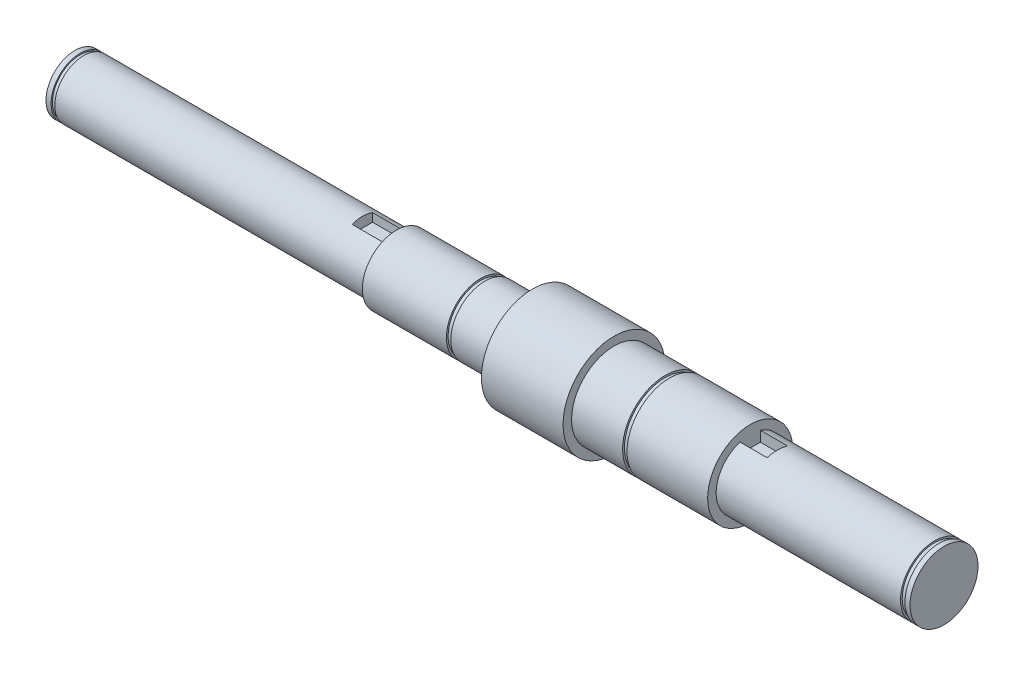
ISO-10303-21;
HEADER;
FILE_DESCRIPTION(('STEP AP214'),'2;1');
FILE_NAME('part.step','',(''),(''),'','','');
FILE_SCHEMA(('AUTOMOTIVE_DESIGN { 1 0 10303 214 1 1 1 1 }'));
ENDSEC;
DATA;
#1=APPLICATION_CONTEXT('core data for automotive mechanical design processes');
#2=APPLICATION_PROTOCOL_DEFINITION('international standard','automotive_design',2000,#1);
#3=PRODUCT_CONTEXT('',#1,'mechanical');
#4=PRODUCT('Part','Part','',(#3));
#5=PRODUCT_RELATED_PRODUCT_CATEGORY('part','',(#4));
#6=PRODUCT_DEFINITION_FORMATION('','',#4);
#7=PRODUCT_DEFINITION_CONTEXT('part definition',#1,'design');
#8=PRODUCT_DEFINITION('design','',#6,#7);
#9=PRODUCT_DEFINITION_SHAPE('','',#8);
#10=(LENGTH_UNIT() NAMED_UNIT(*) SI_UNIT(.MILLI.,.METRE.));
#11=(NAMED_UNIT(*) PLANE_ANGLE_UNIT() SI_UNIT($,.RADIAN.));
#12=(NAMED_UNIT(*) SI_UNIT($,.STERADIAN.) SOLID_ANGLE_UNIT());
#13=UNCERTAINTY_MEASURE_WITH_UNIT(LENGTH_MEASURE(1.E-05),#10,'distance_accuracy_value','');
#14=(GEOMETRIC_REPRESENTATION_CONTEXT(3) GLOBAL_UNCERTAINTY_ASSIGNED_CONTEXT((#13)) GLOBAL_UNIT_ASSIGNED_CONTEXT((#10,
#11,#12)) REPRESENTATION_CONTEXT('',''));
#15=CARTESIAN_POINT('',(0.,0.,0.));
#16=DIRECTION('',(0.,0.,1.));
#17=DIRECTION('',(1.,0.,0.));
#18=AXIS2_PLACEMENT_3D('',#15,#16,#17);
#19=CARTESIAN_POINT('',(-127.75,0.,0.));
#20=DIRECTION('',(-1.,0.,0.));
#21=DIRECTION('',(0.,0.,1.));
#22=AXIS2_PLACEMENT_3D('',#19,#20,#21);
#23=CYLINDRICAL_SURFACE('',#22,10.);
#24=CARTESIAN_POINT('',(124.95,0.,0.));
#25=DIRECTION('',(-1.,0.,0.));
#26=DIRECTION('',(0.,0.,1.));
#27=AXIS2_PLACEMENT_3D('',#24,#25,#26);
#28=CIRCLE('',#27,10.);
#29=CARTESIAN_POINT('',(124.95,0.,10.));
#30=VERTEX_POINT('',#29);
#31=EDGE_CURVE('E178',#30,#30,#28,.T.);
#32=ORIENTED_EDGE('',*,*,#31,.T.);
#33=EDGE_LOOP('',(#32));
#34=FACE_BOUND('',#33,.T.);
#35=DIRECTION('',(-1.,0.,0.));
#36=VECTOR('',#35,1.);
#37=CARTESIAN_POINT('',(-127.75,9.53939201416946,3.));
#38=LINE('',#37,#36);
#39=CARTESIAN_POINT('',(70.75,9.53939201416946,3.));
#40=VERTEX_POINT('',#39);
#41=CARTESIAN_POINT('',(78.75,9.53939201416945,3.));
#42=VERTEX_POINT('',#41);
#43=EDGE_CURVE('E107',#40,#42,#38,.F.);
#44=ORIENTED_EDGE('',*,*,#43,.F.);
#45=CARTESIAN_POINT('',(70.75,0.,0.));
#46=DIRECTION('',(-1.,0.,0.));
#47=DIRECTION('',(0.,0.,1.));
#48=AXIS2_PLACEMENT_3D('',#45,#46,#47);
#49=CIRCLE('',#48,10.);
#50=CARTESIAN_POINT('',(70.75,9.53939201416946,-3.));
#51=VERTEX_POINT('',#50);
#52=EDGE_CURVE('E175',#51,#40,#49,.T.);
#53=ORIENTED_EDGE('',*,*,#52,.F.);
#54=DIRECTION('',(-1.,0.,0.));
#55=VECTOR('',#54,1.);
#56=CARTESIAN_POINT('',(-127.75,9.53939201416946,-3.));
#57=LINE('',#56,#55);
#58=CARTESIAN_POINT('',(78.75,9.53939201416945,-3.));
#59=VERTEX_POINT('',#58);
#60=EDGE_CURVE('E123',#59,#51,#57,.T.);
#61=ORIENTED_EDGE('',*,*,#60,.F.);
#62=CARTESIAN_POINT('',(78.75,0.,0.));
#63=DIRECTION('',(1.,0.,0.));
#64=DIRECTION('',(0.,0.,-1.));
#65=AXIS2_PLACEMENT_3D('',#62,#63,#64);
#66=CIRCLE('',#65,10.);
#67=EDGE_CURVE('E11',#59,#42,#66,.T.);
#68=ORIENTED_EDGE('',*,*,#67,.T.);
#69=EDGE_LOOP('',(#44,#53,#61,#68));
#70=FACE_BOUND('',#69,.T.);
#71=ADVANCED_FACE('F33',(#34,#70),#23,.T.);
#72=CARTESIAN_POINT('',(-127.75,0.,0.));
#73=DIRECTION('',(-1.,0.,0.));
#74=DIRECTION('',(0.,0.,1.));
#75=AXIS2_PLACEMENT_3D('',#72,#73,#74);
#76=CYLINDRICAL_SURFACE('',#75,8.5);
#77=CARTESIAN_POINT('',(-125.15,0.,0.));
#78=DIRECTION('',(-1.,0.,0.));
#79=DIRECTION('',(0.,0.,1.));
#80=AXIS2_PLACEMENT_3D('',#77,#78,#79);
#81=CIRCLE('',#80,8.5);
#82=CARTESIAN_POINT('',(-125.15,0.,8.5));
#83=VERTEX_POINT('',#82);
#84=EDGE_CURVE('E205',#83,#83,#81,.T.);
#85=ORIENTED_EDGE('',*,*,#84,.F.);
#86=EDGE_LOOP('',(#85));
#87=FACE_BOUND('',#86,.T.);
#88=DIRECTION('',(-1.,0.,0.));
#89=VECTOR('',#88,1.);
#90=CARTESIAN_POINT('',(-127.75,7.95298686029343,-3.));
#91=LINE('',#90,#89);
#92=CARTESIAN_POINT('',(-33.25,7.95298686029343,-3.));
#93=VERTEX_POINT('',#92);
#94=CARTESIAN_POINT('',(-43.25,7.95298686029343,-3.));
#95=VERTEX_POINT('',#94);
#96=EDGE_CURVE('E41',#93,#95,#91,.T.);
#97=ORIENTED_EDGE('',*,*,#96,.F.);
#98=CARTESIAN_POINT('',(-33.25,0.,0.));
#99=DIRECTION('',(-1.,0.,0.));
#100=DIRECTION('',(0.,0.,1.));
#101=AXIS2_PLACEMENT_3D('',#98,#99,#100);
#102=CIRCLE('',#101,8.5);
#103=CARTESIAN_POINT('',(-33.25,7.95298686029343,3.));
#104=VERTEX_POINT('',#103);
#105=EDGE_CURVE('E208',#93,#104,#102,.T.);
#106=ORIENTED_EDGE('',*,*,#105,.T.);
#107=DIRECTION('',(-1.,0.,0.));
#108=VECTOR('',#107,1.);
#109=CARTESIAN_POINT('',(-127.75,7.95298686029343,3.));
#110=LINE('',#109,#108);
#111=CARTESIAN_POINT('',(-43.25,7.95298686029343,3.));
#112=VERTEX_POINT('',#111);
#113=EDGE_CURVE('E227',#112,#104,#110,.F.);
#114=ORIENTED_EDGE('',*,*,#113,.F.);
#115=CARTESIAN_POINT('',(-43.25,0.,0.));
#116=DIRECTION('',(1.,0.,0.));
#117=DIRECTION('',(0.,0.,-1.));
#118=AXIS2_PLACEMENT_3D('',#115,#116,#117);
#119=CIRCLE('',#118,8.5);
#120=EDGE_CURVE('E56',#95,#112,#119,.T.);
#121=ORIENTED_EDGE('',*,*,#120,.F.);
#122=EDGE_LOOP('',(#97,#106,#114,#121));
#123=FACE_BOUND('',#122,.T.);
#124=ADVANCED_FACE('F236',(#87,#123),#76,.T.);
#125=CARTESIAN_POINT('',(-127.75,0.,0.));
#126=DIRECTION('',(-1.,0.,0.));
#127=DIRECTION('',(0.,0.,1.));
#128=AXIS2_PLACEMENT_3D('',#125,#126,#127);
#129=CYLINDRICAL_SURFACE('',#128,10.);
#130=CARTESIAN_POINT('',(-7.25000000000001,0.,0.));
#131=DIRECTION('',(-1.,0.,0.));
#132=DIRECTION('',(0.,0.,1.));
#133=AXIS2_PLACEMENT_3D('',#130,#131,#132);
#134=CIRCLE('',#133,10.);
#135=CARTESIAN_POINT('',(-7.25000000000001,0.,10.));
#136=VERTEX_POINT('',#135);
#137=EDGE_CURVE('E223',#136,#136,#134,.T.);
#138=ORIENTED_EDGE('',*,*,#137,.F.);
#139=EDGE_LOOP('',(#138));
#140=FACE_BOUND('',#139,.T.);
#141=CARTESIAN_POINT('',(6.75000000000001,0.,0.));
#142=DIRECTION('',(-1.,0.,0.));
#143=DIRECTION('',(0.,0.,1.));
#144=AXIS2_PLACEMENT_3D('',#141,#142,#143);
#145=CIRCLE('',#144,10.);
#146=CARTESIAN_POINT('',(6.75000000000001,0.,10.));
#147=VERTEX_POINT('',#146);
#148=EDGE_CURVE('E148',#147,#147,#145,.T.);
#149=ORIENTED_EDGE('',*,*,#148,.T.);
#150=EDGE_LOOP('',(#149));
#151=FACE_BOUND('',#150,.T.);
#152=ADVANCED_FACE('F35',(#140,#151),#129,.T.);
#153=CARTESIAN_POINT('',(-7.25,10.,0.));
#154=DIRECTION('',(1.,0.,0.));
#155=DIRECTION('',(0.,0.,-1.));
#156=AXIS2_PLACEMENT_3D('',#153,#154,#155);
#157=PLANE('',#156);
#158=CARTESIAN_POINT('',(-7.25000000000001,0.,0.));
#159=DIRECTION('',(-1.,0.,0.));
#160=DIRECTION('',(0.,0.,1.));
#161=AXIS2_PLACEMENT_3D('',#158,#159,#160);
#162=CIRCLE('',#161,9.5);
#163=CARTESIAN_POINT('',(-7.25000000000001,0.,9.5));
#164=VERTEX_POINT('',#163);
#165=EDGE_CURVE('E220',#164,#164,#162,.T.);
#166=ORIENTED_EDGE('',*,*,#165,.F.);
#167=EDGE_LOOP('',(#166));
#168=FACE_BOUND('',#167,.T.);
#169=ORIENTED_EDGE('',*,*,#137,.T.);
#170=EDGE_LOOP('',(#169));
#171=FACE_BOUND('',#170,.T.);
#172=ADVANCED_FACE('F265',(#168,#171),#157,.F.);
#173=CARTESIAN_POINT('',(-127.75,0.,0.));
#174=DIRECTION('',(-1.,0.,0.));
#175=DIRECTION('',(0.,0.,1.));
#176=AXIS2_PLACEMENT_3D('',#173,#174,#175);
#177=CYLINDRICAL_SURFACE('',#176,9.5);
#178=CARTESIAN_POINT('',(-8.55,0.,0.));
#179=DIRECTION('',(-1.,0.,0.));
#180=DIRECTION('',(0.,0.,1.));
#181=AXIS2_PLACEMENT_3D('',#178,#179,#180);
#182=CIRCLE('',#181,9.5);
#183=CARTESIAN_POINT('',(-8.55,0.,9.5));
#184=VERTEX_POINT('',#183);
#185=EDGE_CURVE('E217',#184,#184,#182,.T.);
#186=ORIENTED_EDGE('',*,*,#185,.F.);
#187=EDGE_LOOP('',(#186));
#188=FACE_BOUND('',#187,.T.);
#189=ORIENTED_EDGE('',*,*,#165,.T.);
#190=EDGE_LOOP('',(#189));
#191=FACE_BOUND('',#190,.T.);
#192=ADVANCED_FACE('F259',(#188,#191),#177,.T.);
#193=CARTESIAN_POINT('',(-8.55,10.,0.));
#194=DIRECTION('',(-1.,0.,0.));
#195=DIRECTION('',(0.,0.,1.));
#196=AXIS2_PLACEMENT_3D('',#193,#194,#195);
#197=PLANE('',#196);
#198=CARTESIAN_POINT('',(-8.55,0.,0.));
#199=DIRECTION('',(-1.,0.,0.));
#200=DIRECTION('',(0.,0.,1.));
#201=AXIS2_PLACEMENT_3D('',#198,#199,#200);
#202=CIRCLE('',#201,10.);
#203=CARTESIAN_POINT('',(-8.55,0.,10.));
#204=VERTEX_POINT('',#203);
#205=EDGE_CURVE('E214',#204,#204,#202,.T.);
#206=ORIENTED_EDGE('',*,*,#205,.F.);
#207=EDGE_LOOP('',(#206));
#208=FACE_BOUND('',#207,.T.);
#209=ORIENTED_EDGE('',*,*,#185,.T.);
#210=EDGE_LOOP('',(#209));
#211=FACE_BOUND('',#210,.T.);
#212=ADVANCED_FACE('F253',(#208,#211),#197,.F.);
#213=CARTESIAN_POINT('',(-127.75,0.,0.));
#214=DIRECTION('',(-1.,0.,0.));
#215=DIRECTION('',(0.,0.,1.));
#216=AXIS2_PLACEMENT_3D('',#213,#214,#215);
#217=CYLINDRICAL_SURFACE('',#216,10.);
#218=CARTESIAN_POINT('',(-33.25,0.,0.));
#219=DIRECTION('',(-1.,0.,0.));
#220=DIRECTION('',(0.,0.,1.));
#221=AXIS2_PLACEMENT_3D('',#218,#219,#220);
#222=CIRCLE('',#221,10.);
#223=CARTESIAN_POINT('',(-33.25,0.,10.));
#224=VERTEX_POINT('',#223);
#225=EDGE_CURVE('E211',#224,#224,#222,.T.);
#226=ORIENTED_EDGE('',*,*,#225,.F.);
#227=EDGE_LOOP('',(#226));
#228=FACE_BOUND('',#227,.T.);
#229=ORIENTED_EDGE('',*,*,#205,.T.);
#230=EDGE_LOOP('',(#229));
#231=FACE_BOUND('',#230,.T.);
#232=ADVANCED_FACE('F247',(#228,#231),#217,.T.);
#233=CARTESIAN_POINT('',(-33.25,8.5,0.));
#234=DIRECTION('',(1.,0.,0.));
#235=DIRECTION('',(0.,0.,-1.));
#236=AXIS2_PLACEMENT_3D('',#233,#234,#235);
#237=PLANE('',#236);
#238=ORIENTED_EDGE('',*,*,#105,.F.);
#239=DIRECTION('',(0.,-1.,0.));
#240=VECTOR('',#239,1.);
#241=CARTESIAN_POINT('',(-33.25,5.5,-3.));
#242=LINE('',#241,#240);
#243=CARTESIAN_POINT('',(-33.25,5.5,-3.));
#244=VERTEX_POINT('',#243);
#245=EDGE_CURVE('E131',#93,#244,#242,.T.);
#246=ORIENTED_EDGE('',*,*,#245,.T.);
#247=DIRECTION('',(0.,0.,1.));
#248=VECTOR('',#247,1.);
#249=CARTESIAN_POINT('',(-33.25,5.5,-3.));
#250=LINE('',#249,#248);
#251=CARTESIAN_POINT('',(-33.25,5.5,3.));
#252=VERTEX_POINT('',#251);
#253=EDGE_CURVE('E140',#244,#252,#250,.T.);
#254=ORIENTED_EDGE('',*,*,#253,.T.);
#255=DIRECTION('',(0.,1.,0.));
#256=VECTOR('',#255,1.);
#257=CARTESIAN_POINT('',(-33.25,5.5,3.));
#258=LINE('',#257,#256);
#259=EDGE_CURVE('E48',#252,#104,#258,.T.);
#260=ORIENTED_EDGE('',*,*,#259,.T.);
#261=EDGE_LOOP('',(#238,#246,#254,#260));
#262=FACE_BOUND('',#261,.T.);
#263=ORIENTED_EDGE('',*,*,#225,.T.);
#264=EDGE_LOOP('',(#263));
#265=FACE_BOUND('',#264,.T.);
#266=ADVANCED_FACE('F243',(#262,#265),#237,.F.);
#267=CARTESIAN_POINT('',(-125.15,8.5,0.));
#268=DIRECTION('',(1.,0.,0.));
#269=DIRECTION('',(0.,0.,-1.));
#270=AXIS2_PLACEMENT_3D('',#267,#268,#269);
#271=PLANE('',#270);
#272=CARTESIAN_POINT('',(-125.15,0.,0.));
#273=DIRECTION('',(-1.,0.,0.));
#274=DIRECTION('',(0.,0.,1.));
#275=AXIS2_PLACEMENT_3D('',#272,#273,#274);
#276=CIRCLE('',#275,8.1);
#277=CARTESIAN_POINT('',(-125.15,0.,8.1));
#278=VERTEX_POINT('',#277);
#279=EDGE_CURVE('E202',#278,#278,#276,.T.);
#280=ORIENTED_EDGE('',*,*,#279,.F.);
#281=EDGE_LOOP('',(#280));
#282=FACE_BOUND('',#281,.T.);
#283=ORIENTED_EDGE('',*,*,#84,.T.);
#284=EDGE_LOOP('',(#283));
#285=FACE_BOUND('',#284,.T.);
#286=ADVANCED_FACE('F246',(#282,#285),#271,.F.);
#287=CARTESIAN_POINT('',(-127.75,0.,0.));
#288=DIRECTION('',(-1.,0.,0.));
#289=DIRECTION('',(0.,0.,1.));
#290=AXIS2_PLACEMENT_3D('',#287,#288,#289);
#291=CYLINDRICAL_SURFACE('',#290,8.1);
#292=CARTESIAN_POINT('',(-126.25,0.,0.));
#293=DIRECTION('',(-1.,0.,0.));
#294=DIRECTION('',(0.,0.,1.));
#295=AXIS2_PLACEMENT_3D('',#292,#293,#294);
#296=CIRCLE('',#295,8.1);
#297=CARTESIAN_POINT('',(-126.25,0.,8.1));
#298=VERTEX_POINT('',#297);
#299=EDGE_CURVE('E199',#298,#298,#296,.T.);
#300=ORIENTED_EDGE('',*,*,#299,.F.);
#301=EDGE_LOOP('',(#300));
#302=FACE_BOUND('',#301,.T.);
#303=ORIENTED_EDGE('',*,*,#279,.T.);
#304=EDGE_LOOP('',(#303));
#305=FACE_BOUND('',#304,.T.);
#306=ADVANCED_FACE('F373',(#302,#305),#291,.T.);
#307=CARTESIAN_POINT('',(-126.25,8.5,0.));
#308=DIRECTION('',(-1.,0.,0.));
#309=DIRECTION('',(0.,0.,1.));
#310=AXIS2_PLACEMENT_3D('',#307,#308,#309);
#311=PLANE('',#310);
#312=CARTESIAN_POINT('',(-126.25,0.,0.));
#313=DIRECTION('',(-1.,0.,0.));
#314=DIRECTION('',(0.,0.,1.));
#315=AXIS2_PLACEMENT_3D('',#312,#313,#314);
#316=CIRCLE('',#315,8.5);
#317=CARTESIAN_POINT('',(-126.25,0.,8.5));
#318=VERTEX_POINT('',#317);
#319=EDGE_CURVE('E196',#318,#318,#316,.T.);
#320=ORIENTED_EDGE('',*,*,#319,.F.);
#321=EDGE_LOOP('',(#320));
#322=FACE_BOUND('',#321,.T.);
#323=ORIENTED_EDGE('',*,*,#299,.T.);
#324=EDGE_LOOP('',(#323));
#325=FACE_BOUND('',#324,.T.);
#326=ADVANCED_FACE('F369',(#322,#325),#311,.F.);
#327=CARTESIAN_POINT('',(-127.75,0.,0.));
#328=DIRECTION('',(-1.,0.,0.));
#329=DIRECTION('',(0.,0.,1.));
#330=AXIS2_PLACEMENT_3D('',#327,#328,#329);
#331=CYLINDRICAL_SURFACE('',#330,8.5);
#332=CARTESIAN_POINT('',(-127.75,0.,0.));
#333=DIRECTION('',(-1.,0.,0.));
#334=DIRECTION('',(0.,0.,1.));
#335=AXIS2_PLACEMENT_3D('',#332,#333,#334);
#336=CIRCLE('',#335,8.5);
#337=CARTESIAN_POINT('',(-127.75,0.,8.5));
#338=VERTEX_POINT('',#337);
#339=EDGE_CURVE('E193',#338,#338,#336,.T.);
#340=ORIENTED_EDGE('',*,*,#339,.F.);
#341=EDGE_LOOP('',(#340));
#342=FACE_BOUND('',#341,.T.);
#343=ORIENTED_EDGE('',*,*,#319,.T.);
#344=EDGE_LOOP('',(#343));
#345=FACE_BOUND('',#344,.T.);
#346=ADVANCED_FACE('F365',(#342,#345),#331,.T.);
#347=CARTESIAN_POINT('',(-127.75,0.,0.));
#348=DIRECTION('',(1.,0.,0.));
#349=DIRECTION('',(0.,0.,-1.));
#350=AXIS2_PLACEMENT_3D('',#347,#348,#349);
#351=PLANE('',#350);
#352=ORIENTED_EDGE('',*,*,#339,.T.);
#353=EDGE_LOOP('',(#352));
#354=FACE_BOUND('',#353,.T.);
#355=ADVANCED_FACE('F361',(#354),#351,.F.);
#356=CARTESIAN_POINT('',(127.75,10.,0.));
#357=DIRECTION('',(-1.,0.,0.));
#358=DIRECTION('',(0.,0.,1.));
#359=AXIS2_PLACEMENT_3D('',#356,#357,#358);
#360=PLANE('',#359);
#361=CARTESIAN_POINT('',(127.75,0.,0.));
#362=DIRECTION('',(-1.,0.,0.));
#363=DIRECTION('',(0.,0.,1.));
#364=AXIS2_PLACEMENT_3D('',#361,#362,#363);
#365=CIRCLE('',#364,10.);
#366=CARTESIAN_POINT('',(127.75,0.,10.));
#367=VERTEX_POINT('',#366);
#368=EDGE_CURVE('E190',#367,#367,#365,.T.);
#369=ORIENTED_EDGE('',*,*,#368,.F.);
#370=EDGE_LOOP('',(#369));
#371=FACE_BOUND('',#370,.T.);
#372=ADVANCED_FACE('F357',(#371),#360,.F.);
#373=CARTESIAN_POINT('',(-127.75,0.,0.));
#374=DIRECTION('',(-1.,0.,0.));
#375=DIRECTION('',(0.,0.,1.));
#376=AXIS2_PLACEMENT_3D('',#373,#374,#375);
#377=CYLINDRICAL_SURFACE('',#376,10.);
#378=CARTESIAN_POINT('',(126.25,0.,0.));
#379=DIRECTION('',(-1.,0.,0.));
#380=DIRECTION('',(0.,0.,1.));
#381=AXIS2_PLACEMENT_3D('',#378,#379,#380);
#382=CIRCLE('',#381,10.);
#383=CARTESIAN_POINT('',(126.25,0.,10.));
#384=VERTEX_POINT('',#383);
#385=EDGE_CURVE('E187',#384,#384,#382,.T.);
#386=ORIENTED_EDGE('',*,*,#385,.F.);
#387=EDGE_LOOP('',(#386));
#388=FACE_BOUND('',#387,.T.);
#389=ORIENTED_EDGE('',*,*,#368,.T.);
#390=EDGE_LOOP('',(#389));
#391=FACE_BOUND('',#390,.T.);
#392=ADVANCED_FACE('F353',(#388,#391),#377,.T.);
#393=CARTESIAN_POINT('',(126.25,10.,0.));
#394=DIRECTION('',(1.,0.,0.));
#395=DIRECTION('',(0.,0.,-1.));
#396=AXIS2_PLACEMENT_3D('',#393,#394,#395);
#397=PLANE('',#396);
#398=CARTESIAN_POINT('',(126.25,0.,0.));
#399=DIRECTION('',(-1.,0.,0.));
#400=DIRECTION('',(0.,0.,1.));
#401=AXIS2_PLACEMENT_3D('',#398,#399,#400);
#402=CIRCLE('',#401,9.5);
#403=CARTESIAN_POINT('',(126.25,0.,9.5));
#404=VERTEX_POINT('',#403);
#405=EDGE_CURVE('E184',#404,#404,#402,.T.);
#406=ORIENTED_EDGE('',*,*,#405,.F.);
#407=EDGE_LOOP('',(#406));
#408=FACE_BOUND('',#407,.T.);
#409=ORIENTED_EDGE('',*,*,#385,.T.);
#410=EDGE_LOOP('',(#409));
#411=FACE_BOUND('',#410,.T.);
#412=ADVANCED_FACE('F349',(#408,#411),#397,.F.);
#413=CARTESIAN_POINT('',(-127.75,0.,0.));
#414=DIRECTION('',(-1.,0.,0.));
#415=DIRECTION('',(0.,0.,1.));
#416=AXIS2_PLACEMENT_3D('',#413,#414,#415);
#417=CYLINDRICAL_SURFACE('',#416,9.5);
#418=CARTESIAN_POINT('',(124.95,0.,0.));
#419=DIRECTION('',(-1.,0.,0.));
#420=DIRECTION('',(0.,0.,1.));
#421=AXIS2_PLACEMENT_3D('',#418,#419,#420);
#422=CIRCLE('',#421,9.5);
#423=CARTESIAN_POINT('',(124.95,0.,9.5));
#424=VERTEX_POINT('',#423);
#425=EDGE_CURVE('E181',#424,#424,#422,.T.);
#426=ORIENTED_EDGE('',*,*,#425,.F.);
#427=EDGE_LOOP('',(#426));
#428=FACE_BOUND('',#427,.T.);
#429=ORIENTED_EDGE('',*,*,#405,.T.);
#430=EDGE_LOOP('',(#429));
#431=FACE_BOUND('',#430,.T.);
#432=ADVANCED_FACE('F333',(#428,#431),#417,.T.);
#433=CARTESIAN_POINT('',(124.95,10.,0.));
#434=DIRECTION('',(-1.,0.,0.));
#435=DIRECTION('',(0.,0.,1.));
#436=AXIS2_PLACEMENT_3D('',#433,#434,#435);
#437=PLANE('',#436);
#438=ORIENTED_EDGE('',*,*,#31,.F.);
#439=EDGE_LOOP('',(#438));
#440=FACE_BOUND('',#439,.T.);
#441=ORIENTED_EDGE('',*,*,#425,.T.);
#442=EDGE_LOOP('',(#441));
#443=FACE_BOUND('',#442,.T.);
#444=ADVANCED_FACE('F327',(#440,#443),#437,.F.);
#445=CARTESIAN_POINT('',(70.75,12.5,0.));
#446=DIRECTION('',(-1.,0.,0.));
#447=DIRECTION('',(0.,0.,1.));
#448=AXIS2_PLACEMENT_3D('',#445,#446,#447);
#449=PLANE('',#448);
#450=DIRECTION('',(0.,1.,0.));
#451=VECTOR('',#450,1.);
#452=CARTESIAN_POINT('',(70.75,10.,-3.));
#453=LINE('',#452,#451);
#454=CARTESIAN_POINT('',(70.75,6.5,-3.));
#455=VERTEX_POINT('',#454);
#456=EDGE_CURVE('E110',#455,#51,#453,.T.);
#457=ORIENTED_EDGE('',*,*,#456,.T.);
#458=ORIENTED_EDGE('',*,*,#52,.T.);
#459=DIRECTION('',(0.,-1.,0.));
#460=VECTOR('',#459,1.);
#461=CARTESIAN_POINT('',(70.75,10.,3.));
#462=LINE('',#461,#460);
#463=CARTESIAN_POINT('',(70.75,6.5,3.));
#464=VERTEX_POINT('',#463);
#465=EDGE_CURVE('E573',#40,#464,#462,.T.);
#466=ORIENTED_EDGE('',*,*,#465,.T.);
#467=DIRECTION('',(0.,0.,-1.));
#468=VECTOR('',#467,1.);
#469=CARTESIAN_POINT('',(70.75,6.5,3.));
#470=LINE('',#469,#468);
#471=EDGE_CURVE('E122',#464,#455,#470,.T.);
#472=ORIENTED_EDGE('',*,*,#471,.T.);
#473=EDGE_LOOP('',(#457,#458,#466,#472));
#474=FACE_BOUND('',#473,.T.);
#475=CARTESIAN_POINT('',(70.75,0.,0.));
#476=DIRECTION('',(-1.,0.,0.));
#477=DIRECTION('',(0.,0.,1.));
#478=AXIS2_PLACEMENT_3D('',#475,#476,#477);
#479=CIRCLE('',#478,12.5);
#480=CARTESIAN_POINT('',(70.75,0.,12.5));
#481=VERTEX_POINT('',#480);
#482=EDGE_CURVE('E172',#481,#481,#479,.T.);
#483=ORIENTED_EDGE('',*,*,#482,.F.);
#484=EDGE_LOOP('',(#483));
#485=FACE_BOUND('',#484,.T.);
#486=ADVANCED_FACE('F322',(#474,#485),#449,.F.);
#487=CARTESIAN_POINT('',(-127.75,0.,0.));
#488=DIRECTION('',(-1.,0.,0.));
#489=DIRECTION('',(0.,0.,1.));
#490=AXIS2_PLACEMENT_3D('',#487,#488,#489);
#491=CYLINDRICAL_SURFACE('',#490,12.5);
#492=CARTESIAN_POINT('',(47.05,0.,0.));
#493=DIRECTION('',(-1.,0.,0.));
#494=DIRECTION('',(0.,0.,1.));
#495=AXIS2_PLACEMENT_3D('',#492,#493,#494);
#496=CIRCLE('',#495,12.5);
#497=CARTESIAN_POINT('',(47.05,0.,12.5));
#498=VERTEX_POINT('',#497);
#499=EDGE_CURVE('E169',#498,#498,#496,.T.);
#500=ORIENTED_EDGE('',*,*,#499,.F.);
#501=EDGE_LOOP('',(#500));
#502=FACE_BOUND('',#501,.T.);
#503=ORIENTED_EDGE('',*,*,#482,.T.);
#504=EDGE_LOOP('',(#503));
#505=FACE_BOUND('',#504,.T.);
#506=ADVANCED_FACE('F316',(#502,#505),#491,.T.);
#507=CARTESIAN_POINT('',(47.05,12.5,0.));
#508=DIRECTION('',(1.,0.,0.));
#509=DIRECTION('',(0.,0.,-1.));
#510=AXIS2_PLACEMENT_3D('',#507,#508,#509);
#511=PLANE('',#510);
#512=CARTESIAN_POINT('',(47.05,0.,0.));
#513=DIRECTION('',(-1.,0.,0.));
#514=DIRECTION('',(0.,0.,1.));
#515=AXIS2_PLACEMENT_3D('',#512,#513,#514);
#516=CIRCLE('',#515,11.95);
#517=CARTESIAN_POINT('',(47.05,0.,11.95));
#518=VERTEX_POINT('',#517);
#519=EDGE_CURVE('E166',#518,#518,#516,.T.);
#520=ORIENTED_EDGE('',*,*,#519,.F.);
#521=EDGE_LOOP('',(#520));
#522=FACE_BOUND('',#521,.T.);
#523=ORIENTED_EDGE('',*,*,#499,.T.);
#524=EDGE_LOOP('',(#523));
#525=FACE_BOUND('',#524,.T.);
#526=ADVANCED_FACE('F310',(#522,#525),#511,.F.);
#527=CARTESIAN_POINT('',(-127.75,0.,0.));
#528=DIRECTION('',(-1.,0.,0.));
#529=DIRECTION('',(0.,0.,1.));
#530=AXIS2_PLACEMENT_3D('',#527,#528,#529);
#531=CYLINDRICAL_SURFACE('',#530,11.95);
#532=CARTESIAN_POINT('',(45.75,0.,0.));
#533=DIRECTION('',(-1.,0.,0.));
#534=DIRECTION('',(0.,0.,1.));
#535=AXIS2_PLACEMENT_3D('',#532,#533,#534);
#536=CIRCLE('',#535,11.95);
#537=CARTESIAN_POINT('',(45.75,0.,11.95));
#538=VERTEX_POINT('',#537);
#539=EDGE_CURVE('E163',#538,#538,#536,.T.);
#540=ORIENTED_EDGE('',*,*,#539,.F.);
#541=EDGE_LOOP('',(#540));
#542=FACE_BOUND('',#541,.T.);
#543=ORIENTED_EDGE('',*,*,#519,.T.);
#544=EDGE_LOOP('',(#543));
#545=FACE_BOUND('',#544,.T.);
#546=ADVANCED_FACE('F304',(#542,#545),#531,.T.);
#547=CARTESIAN_POINT('',(45.75,12.5,0.));
#548=DIRECTION('',(-1.,0.,0.));
#549=DIRECTION('',(0.,0.,1.));
#550=AXIS2_PLACEMENT_3D('',#547,#548,#549);
#551=PLANE('',#550);
#552=CARTESIAN_POINT('',(45.75,0.,0.));
#553=DIRECTION('',(-1.,0.,0.));
#554=DIRECTION('',(0.,0.,1.));
#555=AXIS2_PLACEMENT_3D('',#552,#553,#554);
#556=CIRCLE('',#555,12.5);
#557=CARTESIAN_POINT('',(45.75,0.,12.5));
#558=VERTEX_POINT('',#557);
#559=EDGE_CURVE('E160',#558,#558,#556,.T.);
#560=ORIENTED_EDGE('',*,*,#559,.F.);
#561=EDGE_LOOP('',(#560));
#562=FACE_BOUND('',#561,.T.);
#563=ORIENTED_EDGE('',*,*,#539,.T.);
#564=EDGE_LOOP('',(#563));
#565=FACE_BOUND('',#564,.T.);
#566=ADVANCED_FACE('F298',(#562,#565),#551,.F.);
#567=CARTESIAN_POINT('',(-127.75,0.,0.));
#568=DIRECTION('',(-1.,0.,0.));
#569=DIRECTION('',(0.,0.,1.));
#570=AXIS2_PLACEMENT_3D('',#567,#568,#569);
#571=CYLINDRICAL_SURFACE('',#570,12.5);
#572=CARTESIAN_POINT('',(30.75,0.,0.));
#573=DIRECTION('',(-1.,0.,0.));
#574=DIRECTION('',(0.,0.,1.));
#575=AXIS2_PLACEMENT_3D('',#572,#573,#574);
#576=CIRCLE('',#575,12.5);
#577=CARTESIAN_POINT('',(30.75,0.,12.5));
#578=VERTEX_POINT('',#577);
#579=EDGE_CURVE('E157',#578,#578,#576,.T.);
#580=ORIENTED_EDGE('',*,*,#579,.F.);
#581=EDGE_LOOP('',(#580));
#582=FACE_BOUND('',#581,.T.);
#583=ORIENTED_EDGE('',*,*,#559,.T.);
#584=EDGE_LOOP('',(#583));
#585=FACE_BOUND('',#584,.T.);
#586=ADVANCED_FACE('F292',(#582,#585),#571,.T.);
#587=CARTESIAN_POINT('',(30.75,15.,0.));
#588=DIRECTION('',(-1.,0.,0.));
#589=DIRECTION('',(0.,0.,1.));
#590=AXIS2_PLACEMENT_3D('',#587,#588,#589);
#591=PLANE('',#590);
#592=CARTESIAN_POINT('',(30.75,0.,0.));
#593=DIRECTION('',(-1.,0.,0.));
#594=DIRECTION('',(0.,0.,1.));
#595=AXIS2_PLACEMENT_3D('',#592,#593,#594);
#596=CIRCLE('',#595,15.);
#597=CARTESIAN_POINT('',(30.75,0.,15.));
#598=VERTEX_POINT('',#597);
#599=EDGE_CURVE('E154',#598,#598,#596,.T.);
#600=ORIENTED_EDGE('',*,*,#599,.F.);
#601=EDGE_LOOP('',(#600));
#602=FACE_BOUND('',#601,.T.);
#603=ORIENTED_EDGE('',*,*,#579,.T.);
#604=EDGE_LOOP('',(#603));
#605=FACE_BOUND('',#604,.T.);
#606=ADVANCED_FACE('F286',(#602,#605),#591,.F.);
#607=CARTESIAN_POINT('',(-127.75,0.,0.));
#608=DIRECTION('',(-1.,0.,0.));
#609=DIRECTION('',(0.,0.,1.));
#610=AXIS2_PLACEMENT_3D('',#607,#608,#609);
#611=CYLINDRICAL_SURFACE('',#610,15.);
#612=CARTESIAN_POINT('',(6.75000000000001,0.,0.));
#613=DIRECTION('',(-1.,0.,0.));
#614=DIRECTION('',(0.,0.,1.));
#615=AXIS2_PLACEMENT_3D('',#612,#613,#614);
#616=CIRCLE('',#615,15.);
#617=CARTESIAN_POINT('',(6.75000000000001,0.,15.));
#618=VERTEX_POINT('',#617);
#619=EDGE_CURVE('E151',#618,#618,#616,.T.);
#620=ORIENTED_EDGE('',*,*,#619,.F.);
#621=EDGE_LOOP('',(#620));
#622=FACE_BOUND('',#621,.T.);
#623=ORIENTED_EDGE('',*,*,#599,.T.);
#624=EDGE_LOOP('',(#623));
#625=FACE_BOUND('',#624,.T.);
#626=ADVANCED_FACE('F280',(#622,#625),#611,.T.);
#627=CARTESIAN_POINT('',(6.75,10.,0.));
#628=DIRECTION('',(1.,0.,0.));
#629=DIRECTION('',(0.,0.,-1.));
#630=AXIS2_PLACEMENT_3D('',#627,#628,#629);
#631=PLANE('',#630);
#632=ORIENTED_EDGE('',*,*,#148,.F.);
#633=EDGE_LOOP('',(#632));
#634=FACE_BOUND('',#633,.T.);
#635=ORIENTED_EDGE('',*,*,#619,.T.);
#636=EDGE_LOOP('',(#635));
#637=FACE_BOUND('',#636,.T.);
#638=ADVANCED_FACE('F277',(#634,#637),#631,.F.);
#639=CARTESIAN_POINT('',(-43.25,5.5,-3.));
#640=DIRECTION('',(0.,0.,1.));
#641=DIRECTION('',(0.,-1.,0.));
#642=AXIS2_PLACEMENT_3D('',#639,#640,#641);
#643=PLANE('',#642);
#644=ORIENTED_EDGE('',*,*,#96,.T.);
#645=DIRECTION('',(0.,-1.,0.));
#646=VECTOR('',#645,1.);
#647=CARTESIAN_POINT('',(-43.25,5.5,-3.));
#648=LINE('',#647,#646);
#649=CARTESIAN_POINT('',(-43.25,5.5,-3.));
#650=VERTEX_POINT('',#649);
#651=EDGE_CURVE('E132',#95,#650,#648,.T.);
#652=ORIENTED_EDGE('',*,*,#651,.T.);
#653=DIRECTION('',(1.,0.,0.));
#654=VECTOR('',#653,1.);
#655=CARTESIAN_POINT('',(-43.25,5.5,-3.));
#656=LINE('',#655,#654);
#657=EDGE_CURVE('E145',#650,#244,#656,.T.);
#658=ORIENTED_EDGE('',*,*,#657,.T.);
#659=ORIENTED_EDGE('',*,*,#245,.F.);
#660=EDGE_LOOP('',(#644,#652,#658,#659));
#661=FACE_BOUND('',#660,.T.);
#662=ADVANCED_FACE('F230',(#661),#643,.T.);
#663=CARTESIAN_POINT('',(-43.25,5.5,3.));
#664=DIRECTION('',(0.,0.,-1.));
#665=DIRECTION('',(0.,1.,0.));
#666=AXIS2_PLACEMENT_3D('',#663,#664,#665);
#667=PLANE('',#666);
#668=ORIENTED_EDGE('',*,*,#113,.T.);
#669=ORIENTED_EDGE('',*,*,#259,.F.);
#670=DIRECTION('',(1.,0.,0.));
#671=VECTOR('',#670,1.);
#672=CARTESIAN_POINT('',(-43.25,5.5,3.));
#673=LINE('',#672,#671);
#674=CARTESIAN_POINT('',(-43.25,5.5,3.));
#675=VERTEX_POINT('',#674);
#676=EDGE_CURVE('E138',#675,#252,#673,.T.);
#677=ORIENTED_EDGE('',*,*,#676,.F.);
#678=DIRECTION('',(0.,1.,0.));
#679=VECTOR('',#678,1.);
#680=CARTESIAN_POINT('',(-43.25,5.5,3.));
#681=LINE('',#680,#679);
#682=EDGE_CURVE('E136',#675,#112,#681,.T.);
#683=ORIENTED_EDGE('',*,*,#682,.T.);
#684=EDGE_LOOP('',(#668,#669,#677,#683));
#685=FACE_BOUND('',#684,.T.);
#686=ADVANCED_FACE('F238',(#685),#667,.T.);
#687=CARTESIAN_POINT('',(-43.25,0.,0.));
#688=DIRECTION('',(1.,0.,0.));
#689=DIRECTION('',(0.,0.,-1.));
#690=AXIS2_PLACEMENT_3D('',#687,#688,#689);
#691=PLANE('',#690);
#692=ORIENTED_EDGE('',*,*,#120,.T.);
#693=ORIENTED_EDGE('',*,*,#682,.F.);
#694=DIRECTION('',(0.,0.,1.));
#695=VECTOR('',#694,1.);
#696=CARTESIAN_POINT('',(-43.25,5.5,-3.));
#697=LINE('',#696,#695);
#698=EDGE_CURVE('E134',#650,#675,#697,.T.);
#699=ORIENTED_EDGE('',*,*,#698,.F.);
#700=ORIENTED_EDGE('',*,*,#651,.F.);
#701=EDGE_LOOP('',(#692,#693,#699,#700));
#702=FACE_BOUND('',#701,.T.);
#703=ADVANCED_FACE('F233',(#702),#691,.T.);
#704=CARTESIAN_POINT('',(-43.25,5.5,-3.));
#705=DIRECTION('',(0.,1.,0.));
#706=DIRECTION('',(0.,0.,1.));
#707=AXIS2_PLACEMENT_3D('',#704,#705,#706);
#708=PLANE('',#707);
#709=ORIENTED_EDGE('',*,*,#253,.F.);
#710=ORIENTED_EDGE('',*,*,#657,.F.);
#711=ORIENTED_EDGE('',*,*,#698,.T.);
#712=ORIENTED_EDGE('',*,*,#676,.T.);
#713=EDGE_LOOP('',(#709,#710,#711,#712));
#714=FACE_BOUND('',#713,.T.);
#715=ADVANCED_FACE('F242',(#714),#708,.T.);
#716=CARTESIAN_POINT('',(78.75,0.,0.));
#717=DIRECTION('',(1.,0.,0.));
#718=DIRECTION('',(0.,0.,-1.));
#719=AXIS2_PLACEMENT_3D('',#716,#717,#718);
#720=PLANE('',#719);
#721=DIRECTION('',(0.,1.,0.));
#722=VECTOR('',#721,1.);
#723=CARTESIAN_POINT('',(78.75,10.,-3.));
#724=LINE('',#723,#722);
#725=CARTESIAN_POINT('',(78.75,6.5,-3.));
#726=VERTEX_POINT('',#725);
#727=EDGE_CURVE('E115',#726,#59,#724,.T.);
#728=ORIENTED_EDGE('',*,*,#727,.F.);
#729=DIRECTION('',(0.,0.,-1.));
#730=VECTOR('',#729,1.);
#731=CARTESIAN_POINT('',(78.75,6.5,3.));
#732=LINE('',#731,#730);
#733=CARTESIAN_POINT('',(78.75,6.5,3.));
#734=VERTEX_POINT('',#733);
#735=EDGE_CURVE('E109',#734,#726,#732,.T.);
#736=ORIENTED_EDGE('',*,*,#735,.F.);
#737=DIRECTION('',(0.,-1.,0.));
#738=VECTOR('',#737,1.);
#739=CARTESIAN_POINT('',(78.75,10.,3.));
#740=LINE('',#739,#738);
#741=EDGE_CURVE('E101',#42,#734,#740,.T.);
#742=ORIENTED_EDGE('',*,*,#741,.F.);
#743=ORIENTED_EDGE('',*,*,#67,.F.);
#744=EDGE_LOOP('',(#728,#736,#742,#743));
#745=FACE_BOUND('',#744,.T.);
#746=ADVANCED_FACE('F113',(#745),#720,.F.);
#747=CARTESIAN_POINT('',(78.75,10.,3.));
#748=DIRECTION('',(0.,0.,-1.));
#749=DIRECTION('',(0.,1.,0.));
#750=AXIS2_PLACEMENT_3D('',#747,#748,#749);
#751=PLANE('',#750);
#752=ORIENTED_EDGE('',*,*,#43,.T.);
#753=ORIENTED_EDGE('',*,*,#741,.T.);
#754=DIRECTION('',(-1.,0.,0.));
#755=VECTOR('',#754,1.);
#756=CARTESIAN_POINT('',(78.75,6.5,3.));
#757=LINE('',#756,#755);
#758=EDGE_CURVE('E105',#734,#464,#757,.T.);
#759=ORIENTED_EDGE('',*,*,#758,.T.);
#760=ORIENTED_EDGE('',*,*,#465,.F.);
#761=EDGE_LOOP('',(#752,#753,#759,#760));
#762=FACE_BOUND('',#761,.T.);
#763=ADVANCED_FACE('F103',(#762),#751,.T.);
#764=CARTESIAN_POINT('',(78.75,10.,-3.));
#765=DIRECTION('',(0.,0.,1.));
#766=DIRECTION('',(0.,-1.,0.));
#767=AXIS2_PLACEMENT_3D('',#764,#765,#766);
#768=PLANE('',#767);
#769=ORIENTED_EDGE('',*,*,#60,.T.);
#770=ORIENTED_EDGE('',*,*,#456,.F.);
#771=DIRECTION('',(-1.,0.,0.));
#772=VECTOR('',#771,1.);
#773=CARTESIAN_POINT('',(78.75,6.5,-3.));
#774=LINE('',#773,#772);
#775=EDGE_CURVE('E124',#726,#455,#774,.T.);
#776=ORIENTED_EDGE('',*,*,#775,.F.);
#777=ORIENTED_EDGE('',*,*,#727,.T.);
#778=EDGE_LOOP('',(#769,#770,#776,#777));
#779=FACE_BOUND('',#778,.T.);
#780=ADVANCED_FACE('F549',(#779),#768,.T.);
#781=CARTESIAN_POINT('',(78.75,6.5,3.));
#782=DIRECTION('',(0.,1.,0.));
#783=DIRECTION('',(0.,0.,1.));
#784=AXIS2_PLACEMENT_3D('',#781,#782,#783);
#785=PLANE('',#784);
#786=ORIENTED_EDGE('',*,*,#471,.F.);
#787=ORIENTED_EDGE('',*,*,#758,.F.);
#788=ORIENTED_EDGE('',*,*,#735,.T.);
#789=ORIENTED_EDGE('',*,*,#775,.T.);
#790=EDGE_LOOP('',(#786,#787,#788,#789));
#791=FACE_BOUND('',#790,.T.);
#792=ADVANCED_FACE('F121',(#791),#785,.T.);
#793=CLOSED_SHELL('',(#71,#124,#152,#172,#192,#212,#232,#266,#286,#306,#326,#346,#355,#372,#392,
#412,#432,#444,#486,#506,#526,#546,#566,#586,#606,#626,#638,#662,#686,#703,#715,#746,#763,#780,#792));
#794=MANIFOLD_SOLID_BREP('B2',#793);
#795=ADVANCED_BREP_SHAPE_REPRESENTATION('',(#18,#794),#14);
#796=SHAPE_DEFINITION_REPRESENTATION(#9,#795);
ENDSEC;
END-ISO-10303-21;
